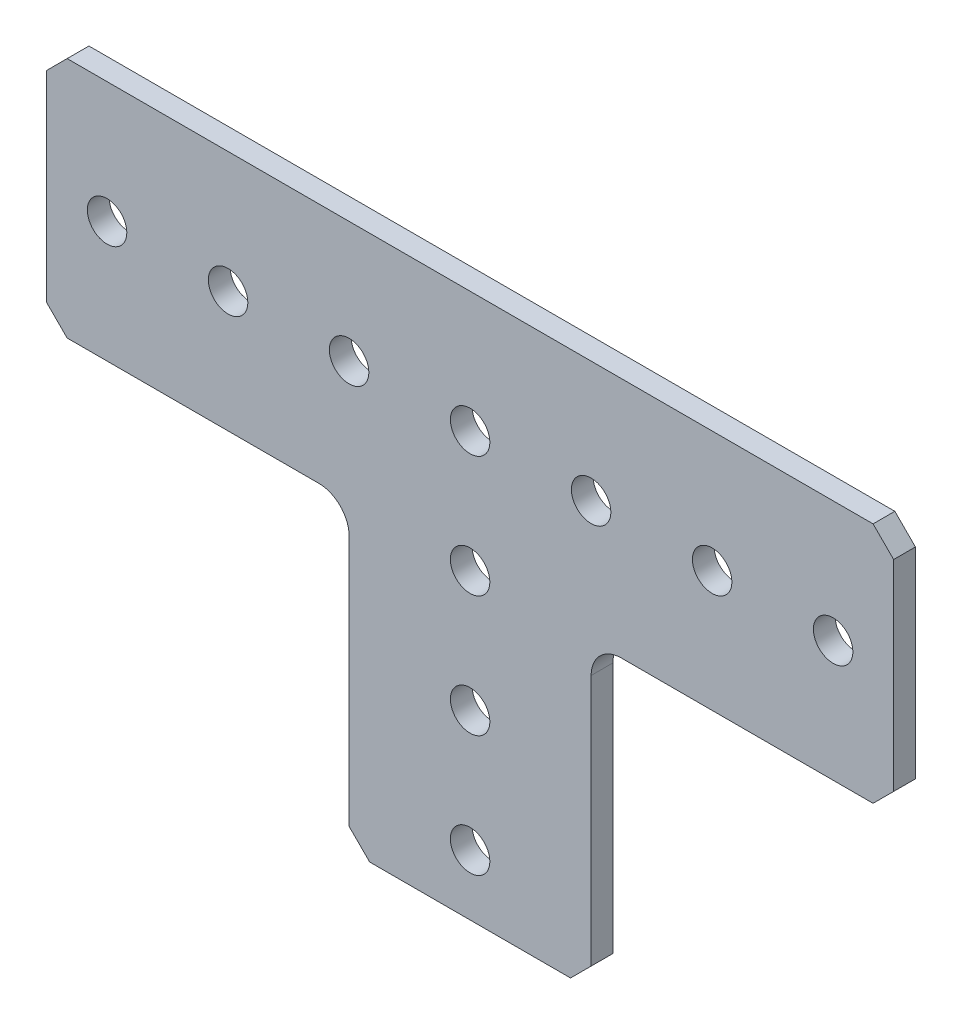
ISO-10303-21;
HEADER;
FILE_DESCRIPTION(('STEP AP214'),'2;1');
FILE_NAME('part.step','',(''),(''),'','','');
FILE_SCHEMA(('AUTOMOTIVE_DESIGN { 1 0 10303 214 1 1 1 1 }'));
ENDSEC;
DATA;
#1=APPLICATION_CONTEXT('core data for automotive mechanical design processes');
#2=APPLICATION_PROTOCOL_DEFINITION('international standard','automotive_design',2000,#1);
#3=PRODUCT_CONTEXT('',#1,'mechanical');
#4=PRODUCT('Part','Part','',(#3));
#5=PRODUCT_RELATED_PRODUCT_CATEGORY('part','',(#4));
#6=PRODUCT_DEFINITION_FORMATION('','',#4);
#7=PRODUCT_DEFINITION_CONTEXT('part definition',#1,'design');
#8=PRODUCT_DEFINITION('design','',#6,#7);
#9=PRODUCT_DEFINITION_SHAPE('','',#8);
#10=(LENGTH_UNIT() NAMED_UNIT(*) SI_UNIT(.MILLI.,.METRE.));
#11=(NAMED_UNIT(*) PLANE_ANGLE_UNIT() SI_UNIT($,.RADIAN.));
#12=(NAMED_UNIT(*) SI_UNIT($,.STERADIAN.) SOLID_ANGLE_UNIT());
#13=UNCERTAINTY_MEASURE_WITH_UNIT(LENGTH_MEASURE(1.E-05),#10,'distance_accuracy_value','');
#14=(GEOMETRIC_REPRESENTATION_CONTEXT(3) GLOBAL_UNCERTAINTY_ASSIGNED_CONTEXT((#13)) GLOBAL_UNIT_ASSIGNED_CONTEXT((#10,
#11,#12)) REPRESENTATION_CONTEXT('',''));
#15=CARTESIAN_POINT('',(0.,0.,0.));
#16=DIRECTION('',(0.,0.,1.));
#17=DIRECTION('',(1.,0.,0.));
#18=AXIS2_PLACEMENT_3D('',#15,#16,#17);
#19=CARTESIAN_POINT('',(12.7,-3.175,2.286));
#20=DIRECTION('',(1.,0.,0.));
#21=DIRECTION('',(0.,1.,0.));
#22=AXIS2_PLACEMENT_3D('',#19,#20,#21);
#23=PLANE('',#22);
#24=DIRECTION('',(0.,-1.,0.));
#25=VECTOR('',#24,1.);
#26=CARTESIAN_POINT('',(12.7,-3.175,0.));
#27=LINE('',#26,#25);
#28=CARTESIAN_POINT('',(12.7,-3.175,0.));
#29=VERTEX_POINT('',#28);
#30=CARTESIAN_POINT('',(12.7,-29.591,0.));
#31=VERTEX_POINT('',#30);
#32=EDGE_CURVE('E178',#29,#31,#27,.T.);
#33=ORIENTED_EDGE('',*,*,#32,.F.);
#34=DIRECTION('',(0.,0.,-1.));
#35=VECTOR('',#34,1.);
#36=CARTESIAN_POINT('',(12.7,-3.175,2.286));
#37=LINE('',#36,#35);
#38=CARTESIAN_POINT('',(12.7,-3.175,2.286));
#39=VERTEX_POINT('',#38);
#40=EDGE_CURVE('E11',#39,#29,#37,.T.);
#41=ORIENTED_EDGE('',*,*,#40,.F.);
#42=DIRECTION('',(0.,-1.,0.));
#43=VECTOR('',#42,1.);
#44=CARTESIAN_POINT('',(12.7,-3.175,2.286));
#45=LINE('',#44,#43);
#46=CARTESIAN_POINT('',(12.7,-29.591,2.286));
#47=VERTEX_POINT('',#46);
#48=EDGE_CURVE('E223',#39,#47,#45,.T.);
#49=ORIENTED_EDGE('',*,*,#48,.T.);
#50=DIRECTION('',(0.,0.,-1.));
#51=VECTOR('',#50,1.);
#52=CARTESIAN_POINT('',(12.7,-29.591,2.286));
#53=LINE('',#52,#51);
#54=EDGE_CURVE('E36',#47,#31,#53,.T.);
#55=ORIENTED_EDGE('',*,*,#54,.T.);
#56=EDGE_LOOP('',(#33,#41,#49,#55));
#57=FACE_BOUND('',#56,.T.);
#58=ADVANCED_FACE('F33',(#57),#23,.T.);
#59=CARTESIAN_POINT('',(15.875,-3.175,2.286));
#60=DIRECTION('',(0.,0.,-1.));
#61=DIRECTION('',(-1.,0.,0.));
#62=AXIS2_PLACEMENT_3D('',#59,#60,#61);
#63=CYLINDRICAL_SURFACE('',#62,3.175);
#64=CARTESIAN_POINT('',(15.875,-3.175,0.));
#65=DIRECTION('',(0.,0.,1.));
#66=DIRECTION('',(1.,0.,0.));
#67=AXIS2_PLACEMENT_3D('',#64,#65,#66);
#68=CIRCLE('',#67,3.175);
#69=CARTESIAN_POINT('',(15.875,0.,0.));
#70=VERTEX_POINT('',#69);
#71=EDGE_CURVE('E221',#70,#29,#68,.T.);
#72=ORIENTED_EDGE('',*,*,#71,.F.);
#73=DIRECTION('',(0.,0.,-1.));
#74=VECTOR('',#73,1.);
#75=CARTESIAN_POINT('',(15.875,0.,2.286));
#76=LINE('',#75,#74);
#77=CARTESIAN_POINT('',(15.875,0.,2.286));
#78=VERTEX_POINT('',#77);
#79=EDGE_CURVE('E42',#78,#70,#76,.T.);
#80=ORIENTED_EDGE('',*,*,#79,.F.);
#81=CARTESIAN_POINT('',(15.875,-3.175,2.286));
#82=DIRECTION('',(0.,0.,1.));
#83=DIRECTION('',(1.,0.,0.));
#84=AXIS2_PLACEMENT_3D('',#81,#82,#83);
#85=CIRCLE('',#84,3.175);
#86=EDGE_CURVE('E168',#78,#39,#85,.T.);
#87=ORIENTED_EDGE('',*,*,#86,.T.);
#88=ORIENTED_EDGE('',*,*,#40,.T.);
#89=EDGE_LOOP('',(#72,#80,#87,#88));
#90=FACE_BOUND('',#89,.T.);
#91=ADVANCED_FACE('F251',(#90),#63,.F.);
#92=CARTESIAN_POINT('',(42.291,0.,2.286));
#93=DIRECTION('',(0.,-1.,0.));
#94=DIRECTION('',(1.,0.,0.));
#95=AXIS2_PLACEMENT_3D('',#92,#93,#94);
#96=PLANE('',#95);
#97=DIRECTION('',(-1.,0.,0.));
#98=VECTOR('',#97,1.);
#99=CARTESIAN_POINT('',(42.291,0.,0.));
#100=LINE('',#99,#98);
#101=CARTESIAN_POINT('',(42.291,0.,0.));
#102=VERTEX_POINT('',#101);
#103=EDGE_CURVE('E155',#102,#70,#100,.T.);
#104=ORIENTED_EDGE('',*,*,#103,.F.);
#105=DIRECTION('',(0.,0.,-1.));
#106=VECTOR('',#105,1.);
#107=CARTESIAN_POINT('',(42.291,0.,2.286));
#108=LINE('',#107,#106);
#109=CARTESIAN_POINT('',(42.291,0.,2.286));
#110=VERTEX_POINT('',#109);
#111=EDGE_CURVE('E150',#110,#102,#108,.T.);
#112=ORIENTED_EDGE('',*,*,#111,.F.);
#113=DIRECTION('',(-1.,0.,0.));
#114=VECTOR('',#113,1.);
#115=CARTESIAN_POINT('',(42.291,0.,2.286));
#116=LINE('',#115,#114);
#117=EDGE_CURVE('E153',#110,#78,#116,.T.);
#118=ORIENTED_EDGE('',*,*,#117,.T.);
#119=ORIENTED_EDGE('',*,*,#79,.T.);
#120=EDGE_LOOP('',(#104,#112,#118,#119));
#121=FACE_BOUND('',#120,.T.);
#122=ADVANCED_FACE('F152',(#121),#96,.T.);
#123=CARTESIAN_POINT('',(44.45,2.15900000000001,2.286));
#124=DIRECTION('',(0.707106781186549,-0.707106781186546,0.));
#125=DIRECTION('',(0.707106781186546,0.707106781186549,0.));
#126=AXIS2_PLACEMENT_3D('',#123,#124,#125);
#127=PLANE('',#126);
#128=DIRECTION('',(-0.707106781186546,-0.707106781186549,0.));
#129=VECTOR('',#128,1.);
#130=CARTESIAN_POINT('',(44.45,2.15900000000001,0.));
#131=LINE('',#130,#129);
#132=CARTESIAN_POINT('',(44.45,2.15900000000001,0.));
#133=VERTEX_POINT('',#132);
#134=EDGE_CURVE('E218',#133,#102,#131,.T.);
#135=ORIENTED_EDGE('',*,*,#134,.F.);
#136=DIRECTION('',(0.,0.,-1.));
#137=VECTOR('',#136,1.);
#138=CARTESIAN_POINT('',(44.45,2.15900000000001,2.286));
#139=LINE('',#138,#137);
#140=CARTESIAN_POINT('',(44.45,2.15900000000001,2.286));
#141=VERTEX_POINT('',#140);
#142=EDGE_CURVE('E160',#141,#133,#139,.T.);
#143=ORIENTED_EDGE('',*,*,#142,.F.);
#144=DIRECTION('',(-0.707106781186546,-0.707106781186549,0.));
#145=VECTOR('',#144,1.);
#146=CARTESIAN_POINT('',(44.45,2.15900000000001,2.286));
#147=LINE('',#146,#145);
#148=EDGE_CURVE('E166',#141,#110,#147,.T.);
#149=ORIENTED_EDGE('',*,*,#148,.T.);
#150=ORIENTED_EDGE('',*,*,#111,.T.);
#151=EDGE_LOOP('',(#135,#143,#149,#150));
#152=FACE_BOUND('',#151,.T.);
#153=ADVANCED_FACE('F170',(#152),#127,.T.);
#154=CARTESIAN_POINT('',(44.45,23.241,2.286));
#155=DIRECTION('',(1.,0.,0.));
#156=DIRECTION('',(0.,0.,-1.));
#157=AXIS2_PLACEMENT_3D('',#154,#155,#156);
#158=PLANE('',#157);
#159=DIRECTION('',(0.,-1.,0.));
#160=VECTOR('',#159,1.);
#161=CARTESIAN_POINT('',(44.45,23.241,0.));
#162=LINE('',#161,#160);
#163=CARTESIAN_POINT('',(44.45,23.241,0.));
#164=VERTEX_POINT('',#163);
#165=EDGE_CURVE('E215',#164,#133,#162,.T.);
#166=ORIENTED_EDGE('',*,*,#165,.F.);
#167=DIRECTION('',(0.,0.,-1.));
#168=VECTOR('',#167,1.);
#169=CARTESIAN_POINT('',(44.45,23.241,2.286));
#170=LINE('',#169,#168);
#171=CARTESIAN_POINT('',(44.45,23.241,2.286));
#172=VERTEX_POINT('',#171);
#173=EDGE_CURVE('E227',#172,#164,#170,.T.);
#174=ORIENTED_EDGE('',*,*,#173,.F.);
#175=DIRECTION('',(0.,-1.,0.));
#176=VECTOR('',#175,1.);
#177=CARTESIAN_POINT('',(44.45,23.241,2.286));
#178=LINE('',#177,#176);
#179=EDGE_CURVE('E171',#172,#141,#178,.T.);
#180=ORIENTED_EDGE('',*,*,#179,.T.);
#181=ORIENTED_EDGE('',*,*,#142,.T.);
#182=EDGE_LOOP('',(#166,#174,#180,#181));
#183=FACE_BOUND('',#182,.T.);
#184=ADVANCED_FACE('F264',(#183),#158,.T.);
#185=CARTESIAN_POINT('',(42.291,25.4,2.286));
#186=DIRECTION('',(0.707106781186544,0.707106781186551,0.));
#187=DIRECTION('',(-0.707106781186551,0.707106781186544,0.));
#188=AXIS2_PLACEMENT_3D('',#185,#186,#187);
#189=PLANE('',#188);
#190=DIRECTION('',(0.707106781186551,-0.707106781186544,0.));
#191=VECTOR('',#190,1.);
#192=CARTESIAN_POINT('',(42.291,25.4,0.));
#193=LINE('',#192,#191);
#194=CARTESIAN_POINT('',(42.291,25.4,0.));
#195=VERTEX_POINT('',#194);
#196=EDGE_CURVE('E212',#195,#164,#193,.T.);
#197=ORIENTED_EDGE('',*,*,#196,.F.);
#198=DIRECTION('',(0.,0.,-1.));
#199=VECTOR('',#198,1.);
#200=CARTESIAN_POINT('',(42.291,25.4,2.286));
#201=LINE('',#200,#199);
#202=CARTESIAN_POINT('',(42.291,25.4,2.286));
#203=VERTEX_POINT('',#202);
#204=EDGE_CURVE('E229',#203,#195,#201,.T.);
#205=ORIENTED_EDGE('',*,*,#204,.F.);
#206=DIRECTION('',(0.707106781186551,-0.707106781186544,0.));
#207=VECTOR('',#206,1.);
#208=CARTESIAN_POINT('',(42.291,25.4,2.286));
#209=LINE('',#208,#207);
#210=EDGE_CURVE('E173',#203,#172,#209,.T.);
#211=ORIENTED_EDGE('',*,*,#210,.T.);
#212=ORIENTED_EDGE('',*,*,#173,.T.);
#213=EDGE_LOOP('',(#197,#205,#211,#212));
#214=FACE_BOUND('',#213,.T.);
#215=ADVANCED_FACE('F267',(#214),#189,.T.);
#216=CARTESIAN_POINT('',(-42.291,25.4,2.286));
#217=DIRECTION('',(0.,1.,0.));
#218=DIRECTION('',(0.,0.,1.));
#219=AXIS2_PLACEMENT_3D('',#216,#217,#218);
#220=PLANE('',#219);
#221=DIRECTION('',(1.,0.,0.));
#222=VECTOR('',#221,1.);
#223=CARTESIAN_POINT('',(-42.291,25.4,0.));
#224=LINE('',#223,#222);
#225=CARTESIAN_POINT('',(-42.291,25.4,0.));
#226=VERTEX_POINT('',#225);
#227=EDGE_CURVE('E209',#226,#195,#224,.T.);
#228=ORIENTED_EDGE('',*,*,#227,.F.);
#229=DIRECTION('',(0.,0.,-1.));
#230=VECTOR('',#229,1.);
#231=CARTESIAN_POINT('',(-42.291,25.4,2.286));
#232=LINE('',#231,#230);
#233=CARTESIAN_POINT('',(-42.291,25.4,2.286));
#234=VERTEX_POINT('',#233);
#235=EDGE_CURVE('E231',#234,#226,#232,.T.);
#236=ORIENTED_EDGE('',*,*,#235,.F.);
#237=DIRECTION('',(1.,0.,0.));
#238=VECTOR('',#237,1.);
#239=CARTESIAN_POINT('',(-42.291,25.4,2.286));
#240=LINE('',#239,#238);
#241=EDGE_CURVE('E449',#234,#203,#240,.T.);
#242=ORIENTED_EDGE('',*,*,#241,.T.);
#243=ORIENTED_EDGE('',*,*,#204,.T.);
#244=EDGE_LOOP('',(#228,#236,#242,#243));
#245=FACE_BOUND('',#244,.T.);
#246=ADVANCED_FACE('F271',(#245),#220,.T.);
#247=CARTESIAN_POINT('',(-44.45,23.241,2.286));
#248=DIRECTION('',(-0.707106781186548,0.707106781186548,0.));
#249=DIRECTION('',(-0.707106781186548,-0.707106781186548,0.));
#250=AXIS2_PLACEMENT_3D('',#247,#248,#249);
#251=PLANE('',#250);
#252=DIRECTION('',(0.707106781186547,0.707106781186547,0.));
#253=VECTOR('',#252,1.);
#254=CARTESIAN_POINT('',(-44.45,23.241,0.));
#255=LINE('',#254,#253);
#256=CARTESIAN_POINT('',(-44.45,23.241,0.));
#257=VERTEX_POINT('',#256);
#258=EDGE_CURVE('E206',#257,#226,#255,.T.);
#259=ORIENTED_EDGE('',*,*,#258,.F.);
#260=DIRECTION('',(0.,0.,-1.));
#261=VECTOR('',#260,1.);
#262=CARTESIAN_POINT('',(-44.45,23.241,2.286));
#263=LINE('',#262,#261);
#264=CARTESIAN_POINT('',(-44.45,23.241,2.286));
#265=VERTEX_POINT('',#264);
#266=EDGE_CURVE('E233',#265,#257,#263,.T.);
#267=ORIENTED_EDGE('',*,*,#266,.F.);
#268=DIRECTION('',(0.707106781186547,0.707106781186547,0.));
#269=VECTOR('',#268,1.);
#270=CARTESIAN_POINT('',(-44.45,23.241,2.286));
#271=LINE('',#270,#269);
#272=EDGE_CURVE('E446',#265,#234,#271,.T.);
#273=ORIENTED_EDGE('',*,*,#272,.T.);
#274=ORIENTED_EDGE('',*,*,#235,.T.);
#275=EDGE_LOOP('',(#259,#267,#273,#274));
#276=FACE_BOUND('',#275,.T.);
#277=ADVANCED_FACE('F275',(#276),#251,.T.);
#278=CARTESIAN_POINT('',(-44.45,2.159,2.286));
#279=DIRECTION('',(-1.,0.,0.));
#280=DIRECTION('',(0.,0.,1.));
#281=AXIS2_PLACEMENT_3D('',#278,#279,#280);
#282=PLANE('',#281);
#283=DIRECTION('',(0.,1.,0.));
#284=VECTOR('',#283,1.);
#285=CARTESIAN_POINT('',(-44.45,2.159,0.));
#286=LINE('',#285,#284);
#287=CARTESIAN_POINT('',(-44.45,2.159,0.));
#288=VERTEX_POINT('',#287);
#289=EDGE_CURVE('E203',#288,#257,#286,.T.);
#290=ORIENTED_EDGE('',*,*,#289,.F.);
#291=DIRECTION('',(0.,0.,-1.));
#292=VECTOR('',#291,1.);
#293=CARTESIAN_POINT('',(-44.45,2.159,2.286));
#294=LINE('',#293,#292);
#295=CARTESIAN_POINT('',(-44.45,2.159,2.286));
#296=VERTEX_POINT('',#295);
#297=EDGE_CURVE('E235',#296,#288,#294,.T.);
#298=ORIENTED_EDGE('',*,*,#297,.F.);
#299=DIRECTION('',(0.,1.,0.));
#300=VECTOR('',#299,1.);
#301=CARTESIAN_POINT('',(-44.45,2.159,2.286));
#302=LINE('',#301,#300);
#303=EDGE_CURVE('E443',#296,#265,#302,.T.);
#304=ORIENTED_EDGE('',*,*,#303,.T.);
#305=ORIENTED_EDGE('',*,*,#266,.T.);
#306=EDGE_LOOP('',(#290,#298,#304,#305));
#307=FACE_BOUND('',#306,.T.);
#308=ADVANCED_FACE('F279',(#307),#282,.T.);
#309=CARTESIAN_POINT('',(-42.291,0.,2.286));
#310=DIRECTION('',(-0.707106781186548,-0.707106781186547,0.));
#311=DIRECTION('',(0.707106781186547,-0.707106781186548,0.));
#312=AXIS2_PLACEMENT_3D('',#309,#310,#311);
#313=PLANE('',#312);
#314=DIRECTION('',(-0.707106781186547,0.707106781186548,0.));
#315=VECTOR('',#314,1.);
#316=CARTESIAN_POINT('',(-42.291,0.,0.));
#317=LINE('',#316,#315);
#318=CARTESIAN_POINT('',(-42.291,0.,0.));
#319=VERTEX_POINT('',#318);
#320=EDGE_CURVE('E200',#319,#288,#317,.T.);
#321=ORIENTED_EDGE('',*,*,#320,.F.);
#322=DIRECTION('',(0.,0.,-1.));
#323=VECTOR('',#322,1.);
#324=CARTESIAN_POINT('',(-42.291,0.,2.286));
#325=LINE('',#324,#323);
#326=CARTESIAN_POINT('',(-42.291,0.,2.286));
#327=VERTEX_POINT('',#326);
#328=EDGE_CURVE('E237',#327,#319,#325,.T.);
#329=ORIENTED_EDGE('',*,*,#328,.F.);
#330=DIRECTION('',(-0.707106781186547,0.707106781186548,0.));
#331=VECTOR('',#330,1.);
#332=CARTESIAN_POINT('',(-42.291,0.,2.286));
#333=LINE('',#332,#331);
#334=EDGE_CURVE('E440',#327,#296,#333,.T.);
#335=ORIENTED_EDGE('',*,*,#334,.T.);
#336=ORIENTED_EDGE('',*,*,#297,.T.);
#337=EDGE_LOOP('',(#321,#329,#335,#336));
#338=FACE_BOUND('',#337,.T.);
#339=ADVANCED_FACE('F283',(#338),#313,.T.);
#340=CARTESIAN_POINT('',(-15.875,0.,2.286));
#341=DIRECTION('',(0.,-1.,0.));
#342=DIRECTION('',(1.,0.,0.));
#343=AXIS2_PLACEMENT_3D('',#340,#341,#342);
#344=PLANE('',#343);
#345=DIRECTION('',(-1.,0.,0.));
#346=VECTOR('',#345,1.);
#347=CARTESIAN_POINT('',(-15.875,0.,0.));
#348=LINE('',#347,#346);
#349=CARTESIAN_POINT('',(-15.875,0.,0.));
#350=VERTEX_POINT('',#349);
#351=EDGE_CURVE('E197',#350,#319,#348,.T.);
#352=ORIENTED_EDGE('',*,*,#351,.F.);
#353=DIRECTION('',(0.,0.,-1.));
#354=VECTOR('',#353,1.);
#355=CARTESIAN_POINT('',(-15.875,0.,2.286));
#356=LINE('',#355,#354);
#357=CARTESIAN_POINT('',(-15.875,0.,2.286));
#358=VERTEX_POINT('',#357);
#359=EDGE_CURVE('E239',#358,#350,#356,.T.);
#360=ORIENTED_EDGE('',*,*,#359,.F.);
#361=DIRECTION('',(-1.,0.,0.));
#362=VECTOR('',#361,1.);
#363=CARTESIAN_POINT('',(-15.875,0.,2.286));
#364=LINE('',#363,#362);
#365=EDGE_CURVE('E437',#358,#327,#364,.T.);
#366=ORIENTED_EDGE('',*,*,#365,.T.);
#367=ORIENTED_EDGE('',*,*,#328,.T.);
#368=EDGE_LOOP('',(#352,#360,#366,#367));
#369=FACE_BOUND('',#368,.T.);
#370=ADVANCED_FACE('F287',(#369),#344,.T.);
#371=CARTESIAN_POINT('',(-15.875,-3.175,2.286));
#372=DIRECTION('',(0.,0.,-1.));
#373=DIRECTION('',(-1.,0.,0.));
#374=AXIS2_PLACEMENT_3D('',#371,#372,#373);
#375=CYLINDRICAL_SURFACE('',#374,3.175);
#376=CARTESIAN_POINT('',(-15.875,-3.175,0.));
#377=DIRECTION('',(0.,0.,1.));
#378=DIRECTION('',(1.,0.,0.));
#379=AXIS2_PLACEMENT_3D('',#376,#377,#378);
#380=CIRCLE('',#379,3.175);
#381=CARTESIAN_POINT('',(-12.7,-3.175,0.));
#382=VERTEX_POINT('',#381);
#383=EDGE_CURVE('E194',#382,#350,#380,.T.);
#384=ORIENTED_EDGE('',*,*,#383,.F.);
#385=DIRECTION('',(0.,0.,-1.));
#386=VECTOR('',#385,1.);
#387=CARTESIAN_POINT('',(-12.7,-3.175,2.286));
#388=LINE('',#387,#386);
#389=CARTESIAN_POINT('',(-12.7,-3.175,2.286));
#390=VERTEX_POINT('',#389);
#391=EDGE_CURVE('E241',#390,#382,#388,.T.);
#392=ORIENTED_EDGE('',*,*,#391,.F.);
#393=CARTESIAN_POINT('',(-15.875,-3.175,2.286));
#394=DIRECTION('',(0.,0.,1.));
#395=DIRECTION('',(1.,0.,0.));
#396=AXIS2_PLACEMENT_3D('',#393,#394,#395);
#397=CIRCLE('',#396,3.175);
#398=EDGE_CURVE('E434',#390,#358,#397,.T.);
#399=ORIENTED_EDGE('',*,*,#398,.T.);
#400=ORIENTED_EDGE('',*,*,#359,.T.);
#401=EDGE_LOOP('',(#384,#392,#399,#400));
#402=FACE_BOUND('',#401,.T.);
#403=ADVANCED_FACE('F291',(#402),#375,.F.);
#404=CARTESIAN_POINT('',(-12.7,-29.591,2.286));
#405=DIRECTION('',(-1.,0.,0.));
#406=DIRECTION('',(0.,-1.,0.));
#407=AXIS2_PLACEMENT_3D('',#404,#405,#406);
#408=PLANE('',#407);
#409=DIRECTION('',(0.,1.,0.));
#410=VECTOR('',#409,1.);
#411=CARTESIAN_POINT('',(-12.7,-29.591,0.));
#412=LINE('',#411,#410);
#413=CARTESIAN_POINT('',(-12.7,-29.591,0.));
#414=VERTEX_POINT('',#413);
#415=EDGE_CURVE('E191',#414,#382,#412,.T.);
#416=ORIENTED_EDGE('',*,*,#415,.F.);
#417=DIRECTION('',(0.,0.,-1.));
#418=VECTOR('',#417,1.);
#419=CARTESIAN_POINT('',(-12.7,-29.591,2.286));
#420=LINE('',#419,#418);
#421=CARTESIAN_POINT('',(-12.7,-29.591,2.286));
#422=VERTEX_POINT('',#421);
#423=EDGE_CURVE('E243',#422,#414,#420,.T.);
#424=ORIENTED_EDGE('',*,*,#423,.F.);
#425=DIRECTION('',(0.,1.,0.));
#426=VECTOR('',#425,1.);
#427=CARTESIAN_POINT('',(-12.7,-29.591,2.286));
#428=LINE('',#427,#426);
#429=EDGE_CURVE('E431',#422,#390,#428,.T.);
#430=ORIENTED_EDGE('',*,*,#429,.T.);
#431=ORIENTED_EDGE('',*,*,#391,.T.);
#432=EDGE_LOOP('',(#416,#424,#430,#431));
#433=FACE_BOUND('',#432,.T.);
#434=ADVANCED_FACE('F295',(#433),#408,.T.);
#435=CARTESIAN_POINT('',(-10.541,-31.75,2.286));
#436=DIRECTION('',(-0.707106781186548,-0.707106781186547,0.));
#437=DIRECTION('',(0.707106781186547,-0.707106781186548,0.));
#438=AXIS2_PLACEMENT_3D('',#435,#436,#437);
#439=PLANE('',#438);
#440=DIRECTION('',(-0.707106781186547,0.707106781186548,0.));
#441=VECTOR('',#440,1.);
#442=CARTESIAN_POINT('',(-10.541,-31.75,0.));
#443=LINE('',#442,#441);
#444=CARTESIAN_POINT('',(-10.541,-31.75,0.));
#445=VERTEX_POINT('',#444);
#446=EDGE_CURVE('E188',#445,#414,#443,.T.);
#447=ORIENTED_EDGE('',*,*,#446,.F.);
#448=DIRECTION('',(0.,0.,-1.));
#449=VECTOR('',#448,1.);
#450=CARTESIAN_POINT('',(-10.541,-31.75,2.286));
#451=LINE('',#450,#449);
#452=CARTESIAN_POINT('',(-10.541,-31.75,2.286));
#453=VERTEX_POINT('',#452);
#454=EDGE_CURVE('E245',#453,#445,#451,.T.);
#455=ORIENTED_EDGE('',*,*,#454,.F.);
#456=DIRECTION('',(-0.707106781186547,0.707106781186548,0.));
#457=VECTOR('',#456,1.);
#458=CARTESIAN_POINT('',(-10.541,-31.75,2.286));
#459=LINE('',#458,#457);
#460=EDGE_CURVE('E428',#453,#422,#459,.T.);
#461=ORIENTED_EDGE('',*,*,#460,.T.);
#462=ORIENTED_EDGE('',*,*,#423,.T.);
#463=EDGE_LOOP('',(#447,#455,#461,#462));
#464=FACE_BOUND('',#463,.T.);
#465=ADVANCED_FACE('F299',(#464),#439,.T.);
#466=CARTESIAN_POINT('',(10.541,-31.75,2.286));
#467=DIRECTION('',(0.,-1.,0.));
#468=DIRECTION('',(0.,0.,-1.));
#469=AXIS2_PLACEMENT_3D('',#466,#467,#468);
#470=PLANE('',#469);
#471=DIRECTION('',(-1.,0.,0.));
#472=VECTOR('',#471,1.);
#473=CARTESIAN_POINT('',(10.541,-31.75,0.));
#474=LINE('',#473,#472);
#475=CARTESIAN_POINT('',(10.541,-31.75,0.));
#476=VERTEX_POINT('',#475);
#477=EDGE_CURVE('E185',#476,#445,#474,.T.);
#478=ORIENTED_EDGE('',*,*,#477,.F.);
#479=DIRECTION('',(0.,0.,-1.));
#480=VECTOR('',#479,1.);
#481=CARTESIAN_POINT('',(10.541,-31.75,2.286));
#482=LINE('',#481,#480);
#483=CARTESIAN_POINT('',(10.541,-31.75,2.286));
#484=VERTEX_POINT('',#483);
#485=EDGE_CURVE('E246',#484,#476,#482,.T.);
#486=ORIENTED_EDGE('',*,*,#485,.F.);
#487=DIRECTION('',(-1.,0.,0.));
#488=VECTOR('',#487,1.);
#489=CARTESIAN_POINT('',(10.541,-31.75,2.286));
#490=LINE('',#489,#488);
#491=EDGE_CURVE('E425',#484,#453,#490,.T.);
#492=ORIENTED_EDGE('',*,*,#491,.T.);
#493=ORIENTED_EDGE('',*,*,#454,.T.);
#494=EDGE_LOOP('',(#478,#486,#492,#493));
#495=FACE_BOUND('',#494,.T.);
#496=ADVANCED_FACE('F303',(#495),#470,.T.);
#497=CARTESIAN_POINT('',(12.7,-29.591,2.286));
#498=DIRECTION('',(0.707106781186548,-0.707106781186547,0.));
#499=DIRECTION('',(0.707106781186547,0.707106781186548,0.));
#500=AXIS2_PLACEMENT_3D('',#497,#498,#499);
#501=PLANE('',#500);
#502=DIRECTION('',(-0.707106781186547,-0.707106781186548,0.));
#503=VECTOR('',#502,1.);
#504=CARTESIAN_POINT('',(12.7,-29.591,0.));
#505=LINE('',#504,#503);
#506=EDGE_CURVE('E181',#31,#476,#505,.T.);
#507=ORIENTED_EDGE('',*,*,#506,.F.);
#508=ORIENTED_EDGE('',*,*,#54,.F.);
#509=DIRECTION('',(-0.707106781186547,-0.707106781186548,0.));
#510=VECTOR('',#509,1.);
#511=CARTESIAN_POINT('',(12.7,-29.591,2.286));
#512=LINE('',#511,#510);
#513=EDGE_CURVE('E423',#47,#484,#512,.T.);
#514=ORIENTED_EDGE('',*,*,#513,.T.);
#515=ORIENTED_EDGE('',*,*,#485,.T.);
#516=EDGE_LOOP('',(#507,#508,#514,#515));
#517=FACE_BOUND('',#516,.T.);
#518=ADVANCED_FACE('F248',(#517),#501,.T.);
#519=CARTESIAN_POINT('',(-15.875,-3.175,2.286));
#520=DIRECTION('',(0.,0.,1.));
#521=DIRECTION('',(1.,0.,0.));
#522=AXIS2_PLACEMENT_3D('',#519,#520,#521);
#523=PLANE('',#522);
#524=CARTESIAN_POINT('',(0.,0.,2.286));
#525=DIRECTION('',(0.,0.,-1.));
#526=DIRECTION('',(1.,0.,0.));
#527=AXIS2_PLACEMENT_3D('',#524,#525,#526);
#528=CIRCLE('',#527,2.0701);
#529=CARTESIAN_POINT('',(2.0701,0.,2.286));
#530=VERTEX_POINT('',#529);
#531=EDGE_CURVE('E362',#530,#530,#528,.T.);
#532=ORIENTED_EDGE('',*,*,#531,.T.);
#533=EDGE_LOOP('',(#532));
#534=FACE_BOUND('',#533,.T.);
#535=CARTESIAN_POINT('',(25.4,12.7,2.286));
#536=DIRECTION('',(0.,0.,-1.));
#537=DIRECTION('',(1.,0.,0.));
#538=AXIS2_PLACEMENT_3D('',#535,#536,#537);
#539=CIRCLE('',#538,2.0701);
#540=CARTESIAN_POINT('',(27.4701,12.7,2.286));
#541=VERTEX_POINT('',#540);
#542=EDGE_CURVE('E370',#541,#541,#539,.T.);
#543=ORIENTED_EDGE('',*,*,#542,.T.);
#544=EDGE_LOOP('',(#543));
#545=FACE_BOUND('',#544,.T.);
#546=CARTESIAN_POINT('',(0.,12.7,2.286));
#547=DIRECTION('',(0.,0.,-1.));
#548=DIRECTION('',(1.,0.,0.));
#549=AXIS2_PLACEMENT_3D('',#546,#547,#548);
#550=CIRCLE('',#549,2.0701);
#551=CARTESIAN_POINT('',(2.0701,12.7,2.286));
#552=VERTEX_POINT('',#551);
#553=EDGE_CURVE('E376',#552,#552,#550,.T.);
#554=ORIENTED_EDGE('',*,*,#553,.T.);
#555=EDGE_LOOP('',(#554));
#556=FACE_BOUND('',#555,.T.);
#557=CARTESIAN_POINT('',(0.,-25.4,2.286));
#558=DIRECTION('',(0.,0.,-1.));
#559=DIRECTION('',(1.,0.,0.));
#560=AXIS2_PLACEMENT_3D('',#557,#558,#559);
#561=CIRCLE('',#560,2.0701);
#562=CARTESIAN_POINT('',(2.0701,-25.4,2.286));
#563=VERTEX_POINT('',#562);
#564=EDGE_CURVE('E382',#563,#563,#561,.T.);
#565=ORIENTED_EDGE('',*,*,#564,.T.);
#566=EDGE_LOOP('',(#565));
#567=FACE_BOUND('',#566,.T.);
#568=CARTESIAN_POINT('',(-38.1,12.7,2.286));
#569=DIRECTION('',(0.,0.,-1.));
#570=DIRECTION('',(1.,0.,0.));
#571=AXIS2_PLACEMENT_3D('',#568,#569,#570);
#572=CIRCLE('',#571,2.0701);
#573=CARTESIAN_POINT('',(-36.0299,12.7,2.286));
#574=VERTEX_POINT('',#573);
#575=EDGE_CURVE('E388',#574,#574,#572,.T.);
#576=ORIENTED_EDGE('',*,*,#575,.T.);
#577=EDGE_LOOP('',(#576));
#578=FACE_BOUND('',#577,.T.);
#579=CARTESIAN_POINT('',(-25.4,12.7,2.286));
#580=DIRECTION('',(0.,0.,-1.));
#581=DIRECTION('',(1.,0.,0.));
#582=AXIS2_PLACEMENT_3D('',#579,#580,#581);
#583=CIRCLE('',#582,2.0701);
#584=CARTESIAN_POINT('',(-23.3299,12.7,2.286));
#585=VERTEX_POINT('',#584);
#586=EDGE_CURVE('E394',#585,#585,#583,.T.);
#587=ORIENTED_EDGE('',*,*,#586,.T.);
#588=EDGE_LOOP('',(#587));
#589=FACE_BOUND('',#588,.T.);
#590=CARTESIAN_POINT('',(-12.7,12.7,2.286));
#591=DIRECTION('',(0.,0.,-1.));
#592=DIRECTION('',(1.,0.,0.));
#593=AXIS2_PLACEMENT_3D('',#590,#591,#592);
#594=CIRCLE('',#593,2.0701);
#595=CARTESIAN_POINT('',(-10.6299,12.7,2.286));
#596=VERTEX_POINT('',#595);
#597=EDGE_CURVE('E400',#596,#596,#594,.T.);
#598=ORIENTED_EDGE('',*,*,#597,.T.);
#599=EDGE_LOOP('',(#598));
#600=FACE_BOUND('',#599,.T.);
#601=CARTESIAN_POINT('',(12.7,12.7,2.286));
#602=DIRECTION('',(0.,0.,-1.));
#603=DIRECTION('',(1.,0.,0.));
#604=AXIS2_PLACEMENT_3D('',#601,#602,#603);
#605=CIRCLE('',#604,2.0701);
#606=CARTESIAN_POINT('',(14.7701,12.7,2.286));
#607=VERTEX_POINT('',#606);
#608=EDGE_CURVE('E406',#607,#607,#605,.T.);
#609=ORIENTED_EDGE('',*,*,#608,.T.);
#610=EDGE_LOOP('',(#609));
#611=FACE_BOUND('',#610,.T.);
#612=CARTESIAN_POINT('',(38.1,12.7,2.286));
#613=DIRECTION('',(0.,0.,-1.));
#614=DIRECTION('',(1.,0.,0.));
#615=AXIS2_PLACEMENT_3D('',#612,#613,#614);
#616=CIRCLE('',#615,2.0701);
#617=CARTESIAN_POINT('',(40.1701,12.7,2.286));
#618=VERTEX_POINT('',#617);
#619=EDGE_CURVE('E412',#618,#618,#616,.T.);
#620=ORIENTED_EDGE('',*,*,#619,.T.);
#621=EDGE_LOOP('',(#620));
#622=FACE_BOUND('',#621,.T.);
#623=CARTESIAN_POINT('',(0.,-12.7,2.286));
#624=DIRECTION('',(0.,0.,-1.));
#625=DIRECTION('',(1.,0.,0.));
#626=AXIS2_PLACEMENT_3D('',#623,#624,#625);
#627=CIRCLE('',#626,2.0701);
#628=CARTESIAN_POINT('',(2.0701,-12.7,2.286));
#629=VERTEX_POINT('',#628);
#630=EDGE_CURVE('E182',#629,#629,#627,.T.);
#631=ORIENTED_EDGE('',*,*,#630,.T.);
#632=EDGE_LOOP('',(#631));
#633=FACE_BOUND('',#632,.T.);
#634=ORIENTED_EDGE('',*,*,#48,.F.);
#635=ORIENTED_EDGE('',*,*,#86,.F.);
#636=ORIENTED_EDGE('',*,*,#117,.F.);
#637=ORIENTED_EDGE('',*,*,#148,.F.);
#638=ORIENTED_EDGE('',*,*,#179,.F.);
#639=ORIENTED_EDGE('',*,*,#210,.F.);
#640=ORIENTED_EDGE('',*,*,#241,.F.);
#641=ORIENTED_EDGE('',*,*,#272,.F.);
#642=ORIENTED_EDGE('',*,*,#303,.F.);
#643=ORIENTED_EDGE('',*,*,#334,.F.);
#644=ORIENTED_EDGE('',*,*,#365,.F.);
#645=ORIENTED_EDGE('',*,*,#398,.F.);
#646=ORIENTED_EDGE('',*,*,#429,.F.);
#647=ORIENTED_EDGE('',*,*,#460,.F.);
#648=ORIENTED_EDGE('',*,*,#491,.F.);
#649=ORIENTED_EDGE('',*,*,#513,.F.);
#650=EDGE_LOOP('',(#634,#635,#636,#637,#638,#639,#640,#641,#642,#643,#644,#645,#646,#647,#648,#649));
#651=FACE_BOUND('',#650,.T.);
#652=ADVANCED_FACE('F164',(#534,#545,#556,#567,#578,#589,#600,#611,#622,#633,#651),#523,.T.);
#653=CARTESIAN_POINT('',(-15.875,-3.175,0.));
#654=DIRECTION('',(0.,0.,1.));
#655=DIRECTION('',(1.,0.,0.));
#656=AXIS2_PLACEMENT_3D('',#653,#654,#655);
#657=PLANE('',#656);
#658=CARTESIAN_POINT('',(0.,0.,0.));
#659=DIRECTION('',(0.,0.,-1.));
#660=DIRECTION('',(1.,0.,0.));
#661=AXIS2_PLACEMENT_3D('',#658,#659,#660);
#662=CIRCLE('',#661,2.0701);
#663=CARTESIAN_POINT('',(2.0701,0.,0.));
#664=VERTEX_POINT('',#663);
#665=EDGE_CURVE('E365',#664,#664,#662,.T.);
#666=ORIENTED_EDGE('',*,*,#665,.F.);
#667=EDGE_LOOP('',(#666));
#668=FACE_BOUND('',#667,.T.);
#669=CARTESIAN_POINT('',(25.4,12.7,0.));
#670=DIRECTION('',(0.,0.,-1.));
#671=DIRECTION('',(1.,0.,0.));
#672=AXIS2_PLACEMENT_3D('',#669,#670,#671);
#673=CIRCLE('',#672,2.0701);
#674=CARTESIAN_POINT('',(27.4701,12.7,0.));
#675=VERTEX_POINT('',#674);
#676=EDGE_CURVE('E367',#675,#675,#673,.T.);
#677=ORIENTED_EDGE('',*,*,#676,.F.);
#678=EDGE_LOOP('',(#677));
#679=FACE_BOUND('',#678,.T.);
#680=CARTESIAN_POINT('',(0.,12.7,0.));
#681=DIRECTION('',(0.,0.,-1.));
#682=DIRECTION('',(1.,0.,0.));
#683=AXIS2_PLACEMENT_3D('',#680,#681,#682);
#684=CIRCLE('',#683,2.0701);
#685=CARTESIAN_POINT('',(2.0701,12.7,0.));
#686=VERTEX_POINT('',#685);
#687=EDGE_CURVE('E373',#686,#686,#684,.T.);
#688=ORIENTED_EDGE('',*,*,#687,.F.);
#689=EDGE_LOOP('',(#688));
#690=FACE_BOUND('',#689,.T.);
#691=CARTESIAN_POINT('',(0.,-25.4,0.));
#692=DIRECTION('',(0.,0.,-1.));
#693=DIRECTION('',(1.,0.,0.));
#694=AXIS2_PLACEMENT_3D('',#691,#692,#693);
#695=CIRCLE('',#694,2.0701);
#696=CARTESIAN_POINT('',(2.0701,-25.4,0.));
#697=VERTEX_POINT('',#696);
#698=EDGE_CURVE('E379',#697,#697,#695,.T.);
#699=ORIENTED_EDGE('',*,*,#698,.F.);
#700=EDGE_LOOP('',(#699));
#701=FACE_BOUND('',#700,.T.);
#702=CARTESIAN_POINT('',(-38.1,12.7,0.));
#703=DIRECTION('',(0.,0.,-1.));
#704=DIRECTION('',(1.,0.,0.));
#705=AXIS2_PLACEMENT_3D('',#702,#703,#704);
#706=CIRCLE('',#705,2.0701);
#707=CARTESIAN_POINT('',(-36.0299,12.7,0.));
#708=VERTEX_POINT('',#707);
#709=EDGE_CURVE('E385',#708,#708,#706,.T.);
#710=ORIENTED_EDGE('',*,*,#709,.F.);
#711=EDGE_LOOP('',(#710));
#712=FACE_BOUND('',#711,.T.);
#713=CARTESIAN_POINT('',(-25.4,12.7,0.));
#714=DIRECTION('',(0.,0.,-1.));
#715=DIRECTION('',(1.,0.,0.));
#716=AXIS2_PLACEMENT_3D('',#713,#714,#715);
#717=CIRCLE('',#716,2.0701);
#718=CARTESIAN_POINT('',(-23.3299,12.7,0.));
#719=VERTEX_POINT('',#718);
#720=EDGE_CURVE('E391',#719,#719,#717,.T.);
#721=ORIENTED_EDGE('',*,*,#720,.F.);
#722=EDGE_LOOP('',(#721));
#723=FACE_BOUND('',#722,.T.);
#724=CARTESIAN_POINT('',(-12.7,12.7,0.));
#725=DIRECTION('',(0.,0.,-1.));
#726=DIRECTION('',(1.,0.,0.));
#727=AXIS2_PLACEMENT_3D('',#724,#725,#726);
#728=CIRCLE('',#727,2.0701);
#729=CARTESIAN_POINT('',(-10.6299,12.7,0.));
#730=VERTEX_POINT('',#729);
#731=EDGE_CURVE('E397',#730,#730,#728,.T.);
#732=ORIENTED_EDGE('',*,*,#731,.F.);
#733=EDGE_LOOP('',(#732));
#734=FACE_BOUND('',#733,.T.);
#735=CARTESIAN_POINT('',(12.7,12.7,0.));
#736=DIRECTION('',(0.,0.,-1.));
#737=DIRECTION('',(1.,0.,0.));
#738=AXIS2_PLACEMENT_3D('',#735,#736,#737);
#739=CIRCLE('',#738,2.0701);
#740=CARTESIAN_POINT('',(14.7701,12.7,0.));
#741=VERTEX_POINT('',#740);
#742=EDGE_CURVE('E403',#741,#741,#739,.T.);
#743=ORIENTED_EDGE('',*,*,#742,.F.);
#744=EDGE_LOOP('',(#743));
#745=FACE_BOUND('',#744,.T.);
#746=CARTESIAN_POINT('',(38.1,12.7,0.));
#747=DIRECTION('',(0.,0.,-1.));
#748=DIRECTION('',(1.,0.,0.));
#749=AXIS2_PLACEMENT_3D('',#746,#747,#748);
#750=CIRCLE('',#749,2.0701);
#751=CARTESIAN_POINT('',(40.1701,12.7,0.));
#752=VERTEX_POINT('',#751);
#753=EDGE_CURVE('E409',#752,#752,#750,.T.);
#754=ORIENTED_EDGE('',*,*,#753,.F.);
#755=EDGE_LOOP('',(#754));
#756=FACE_BOUND('',#755,.T.);
#757=CARTESIAN_POINT('',(0.,-12.7,0.));
#758=DIRECTION('',(0.,0.,-1.));
#759=DIRECTION('',(1.,0.,0.));
#760=AXIS2_PLACEMENT_3D('',#757,#758,#759);
#761=CIRCLE('',#760,2.0701);
#762=CARTESIAN_POINT('',(2.0701,-12.7,0.));
#763=VERTEX_POINT('',#762);
#764=EDGE_CURVE('E415',#763,#763,#761,.T.);
#765=ORIENTED_EDGE('',*,*,#764,.F.);
#766=EDGE_LOOP('',(#765));
#767=FACE_BOUND('',#766,.T.);
#768=ORIENTED_EDGE('',*,*,#32,.T.);
#769=ORIENTED_EDGE('',*,*,#506,.T.);
#770=ORIENTED_EDGE('',*,*,#477,.T.);
#771=ORIENTED_EDGE('',*,*,#446,.T.);
#772=ORIENTED_EDGE('',*,*,#415,.T.);
#773=ORIENTED_EDGE('',*,*,#383,.T.);
#774=ORIENTED_EDGE('',*,*,#351,.T.);
#775=ORIENTED_EDGE('',*,*,#320,.T.);
#776=ORIENTED_EDGE('',*,*,#289,.T.);
#777=ORIENTED_EDGE('',*,*,#258,.T.);
#778=ORIENTED_EDGE('',*,*,#227,.T.);
#779=ORIENTED_EDGE('',*,*,#196,.T.);
#780=ORIENTED_EDGE('',*,*,#165,.T.);
#781=ORIENTED_EDGE('',*,*,#134,.T.);
#782=ORIENTED_EDGE('',*,*,#103,.T.);
#783=ORIENTED_EDGE('',*,*,#71,.T.);
#784=EDGE_LOOP('',(#768,#769,#770,#771,#772,#773,#774,#775,#776,#777,#778,#779,#780,#781,#782,#783));
#785=FACE_BOUND('',#784,.T.);
#786=ADVANCED_FACE('F250',(#668,#679,#690,#701,#712,#723,#734,#745,#756,#767,#785),#657,.F.);
#787=CARTESIAN_POINT('',(0.,-12.7,2.286));
#788=DIRECTION('',(0.,0.,-1.));
#789=DIRECTION('',(-1.,0.,0.));
#790=AXIS2_PLACEMENT_3D('',#787,#788,#789);
#791=CYLINDRICAL_SURFACE('',#790,2.0701);
#792=ORIENTED_EDGE('',*,*,#630,.F.);
#793=EDGE_LOOP('',(#792));
#794=FACE_BOUND('',#793,.T.);
#795=ORIENTED_EDGE('',*,*,#764,.T.);
#796=EDGE_LOOP('',(#795));
#797=FACE_BOUND('',#796,.T.);
#798=ADVANCED_FACE('F315',(#794,#797),#791,.F.);
#799=CARTESIAN_POINT('',(38.1,12.7,2.286));
#800=DIRECTION('',(0.,0.,-1.));
#801=DIRECTION('',(-1.,0.,0.));
#802=AXIS2_PLACEMENT_3D('',#799,#800,#801);
#803=CYLINDRICAL_SURFACE('',#802,2.0701);
#804=ORIENTED_EDGE('',*,*,#619,.F.);
#805=EDGE_LOOP('',(#804));
#806=FACE_BOUND('',#805,.T.);
#807=ORIENTED_EDGE('',*,*,#753,.T.);
#808=EDGE_LOOP('',(#807));
#809=FACE_BOUND('',#808,.T.);
#810=ADVANCED_FACE('F322',(#806,#809),#803,.F.);
#811=CARTESIAN_POINT('',(12.7,12.7,2.286));
#812=DIRECTION('',(0.,0.,-1.));
#813=DIRECTION('',(-1.,0.,0.));
#814=AXIS2_PLACEMENT_3D('',#811,#812,#813);
#815=CYLINDRICAL_SURFACE('',#814,2.0701);
#816=ORIENTED_EDGE('',*,*,#608,.F.);
#817=EDGE_LOOP('',(#816));
#818=FACE_BOUND('',#817,.T.);
#819=ORIENTED_EDGE('',*,*,#742,.T.);
#820=EDGE_LOOP('',(#819));
#821=FACE_BOUND('',#820,.T.);
#822=ADVANCED_FACE('F326',(#818,#821),#815,.F.);
#823=CARTESIAN_POINT('',(-12.7,12.7,2.286));
#824=DIRECTION('',(0.,0.,-1.));
#825=DIRECTION('',(-1.,0.,0.));
#826=AXIS2_PLACEMENT_3D('',#823,#824,#825);
#827=CYLINDRICAL_SURFACE('',#826,2.0701);
#828=ORIENTED_EDGE('',*,*,#597,.F.);
#829=EDGE_LOOP('',(#828));
#830=FACE_BOUND('',#829,.T.);
#831=ORIENTED_EDGE('',*,*,#731,.T.);
#832=EDGE_LOOP('',(#831));
#833=FACE_BOUND('',#832,.T.);
#834=ADVANCED_FACE('F330',(#830,#833),#827,.F.);
#835=CARTESIAN_POINT('',(-25.4,12.7,2.286));
#836=DIRECTION('',(0.,0.,-1.));
#837=DIRECTION('',(-1.,0.,0.));
#838=AXIS2_PLACEMENT_3D('',#835,#836,#837);
#839=CYLINDRICAL_SURFACE('',#838,2.0701);
#840=ORIENTED_EDGE('',*,*,#586,.F.);
#841=EDGE_LOOP('',(#840));
#842=FACE_BOUND('',#841,.T.);
#843=ORIENTED_EDGE('',*,*,#720,.T.);
#844=EDGE_LOOP('',(#843));
#845=FACE_BOUND('',#844,.T.);
#846=ADVANCED_FACE('F334',(#842,#845),#839,.F.);
#847=CARTESIAN_POINT('',(-38.1,12.7,2.286));
#848=DIRECTION('',(0.,0.,-1.));
#849=DIRECTION('',(-1.,0.,0.));
#850=AXIS2_PLACEMENT_3D('',#847,#848,#849);
#851=CYLINDRICAL_SURFACE('',#850,2.0701);
#852=ORIENTED_EDGE('',*,*,#575,.F.);
#853=EDGE_LOOP('',(#852));
#854=FACE_BOUND('',#853,.T.);
#855=ORIENTED_EDGE('',*,*,#709,.T.);
#856=EDGE_LOOP('',(#855));
#857=FACE_BOUND('',#856,.T.);
#858=ADVANCED_FACE('F338',(#854,#857),#851,.F.);
#859=CARTESIAN_POINT('',(0.,-25.4,2.286));
#860=DIRECTION('',(0.,0.,-1.));
#861=DIRECTION('',(-1.,0.,0.));
#862=AXIS2_PLACEMENT_3D('',#859,#860,#861);
#863=CYLINDRICAL_SURFACE('',#862,2.0701);
#864=ORIENTED_EDGE('',*,*,#564,.F.);
#865=EDGE_LOOP('',(#864));
#866=FACE_BOUND('',#865,.T.);
#867=ORIENTED_EDGE('',*,*,#698,.T.);
#868=EDGE_LOOP('',(#867));
#869=FACE_BOUND('',#868,.T.);
#870=ADVANCED_FACE('F342',(#866,#869),#863,.F.);
#871=CARTESIAN_POINT('',(0.,12.7,2.286));
#872=DIRECTION('',(0.,0.,-1.));
#873=DIRECTION('',(-1.,0.,0.));
#874=AXIS2_PLACEMENT_3D('',#871,#872,#873);
#875=CYLINDRICAL_SURFACE('',#874,2.0701);
#876=ORIENTED_EDGE('',*,*,#553,.F.);
#877=EDGE_LOOP('',(#876));
#878=FACE_BOUND('',#877,.T.);
#879=ORIENTED_EDGE('',*,*,#687,.T.);
#880=EDGE_LOOP('',(#879));
#881=FACE_BOUND('',#880,.T.);
#882=ADVANCED_FACE('F346',(#878,#881),#875,.F.);
#883=CARTESIAN_POINT('',(25.4,12.7,2.286));
#884=DIRECTION('',(0.,0.,-1.));
#885=DIRECTION('',(-1.,0.,0.));
#886=AXIS2_PLACEMENT_3D('',#883,#884,#885);
#887=CYLINDRICAL_SURFACE('',#886,2.0701);
#888=ORIENTED_EDGE('',*,*,#542,.F.);
#889=EDGE_LOOP('',(#888));
#890=FACE_BOUND('',#889,.T.);
#891=ORIENTED_EDGE('',*,*,#676,.T.);
#892=EDGE_LOOP('',(#891));
#893=FACE_BOUND('',#892,.T.);
#894=ADVANCED_FACE('F350',(#890,#893),#887,.F.);
#895=CARTESIAN_POINT('',(0.,0.,2.286));
#896=DIRECTION('',(0.,0.,-1.));
#897=DIRECTION('',(-1.,0.,0.));
#898=AXIS2_PLACEMENT_3D('',#895,#896,#897);
#899=CYLINDRICAL_SURFACE('',#898,2.0701);
#900=ORIENTED_EDGE('',*,*,#531,.F.);
#901=EDGE_LOOP('',(#900));
#902=FACE_BOUND('',#901,.T.);
#903=ORIENTED_EDGE('',*,*,#665,.T.);
#904=EDGE_LOOP('',(#903));
#905=FACE_BOUND('',#904,.T.);
#906=ADVANCED_FACE('F354',(#902,#905),#899,.F.);
#907=CLOSED_SHELL('',(#58,#91,#122,#153,#184,#215,#246,#277,#308,#339,#370,#403,#434,#465,#496,
#518,#652,#786,#798,#810,#822,#834,#846,#858,#870,#882,#894,#906));
#908=MANIFOLD_SOLID_BREP('B2',#907);
#909=ADVANCED_BREP_SHAPE_REPRESENTATION('',(#18,#908),#14);
#910=SHAPE_DEFINITION_REPRESENTATION(#9,#909);
ENDSEC;
END-ISO-10303-21;
